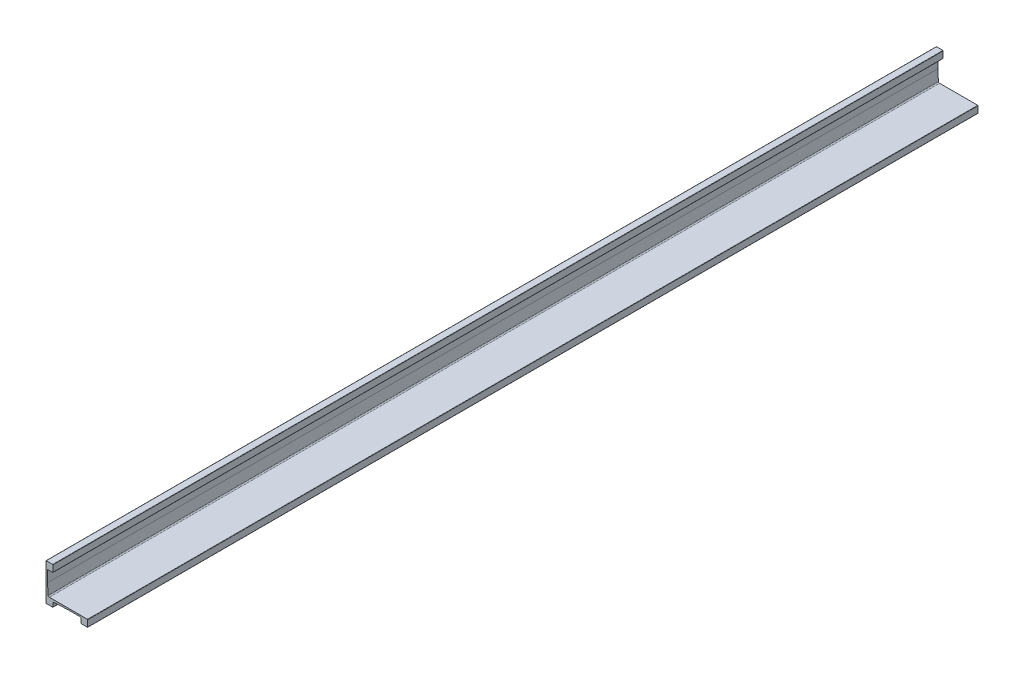
ISO-10303-21;
HEADER;
FILE_DESCRIPTION(('STEP AP214'),'2;1');
FILE_NAME('part.step','',(''),(''),'','','');
FILE_SCHEMA(('AUTOMOTIVE_DESIGN { 1 0 10303 214 1 1 1 1 }'));
ENDSEC;
DATA;
#1=APPLICATION_CONTEXT('core data for automotive mechanical design processes');
#2=APPLICATION_PROTOCOL_DEFINITION('international standard','automotive_design',2000,#1);
#3=PRODUCT_CONTEXT('',#1,'mechanical');
#4=PRODUCT('Part','Part','',(#3));
#5=PRODUCT_RELATED_PRODUCT_CATEGORY('part','',(#4));
#6=PRODUCT_DEFINITION_FORMATION('','',#4);
#7=PRODUCT_DEFINITION_CONTEXT('part definition',#1,'design');
#8=PRODUCT_DEFINITION('design','',#6,#7);
#9=PRODUCT_DEFINITION_SHAPE('','',#8);
#10=(LENGTH_UNIT() NAMED_UNIT(*) SI_UNIT(.MILLI.,.METRE.));
#11=(NAMED_UNIT(*) PLANE_ANGLE_UNIT() SI_UNIT($,.RADIAN.));
#12=(NAMED_UNIT(*) SI_UNIT($,.STERADIAN.) SOLID_ANGLE_UNIT());
#13=UNCERTAINTY_MEASURE_WITH_UNIT(LENGTH_MEASURE(1.E-05),#10,'distance_accuracy_value','');
#14=(GEOMETRIC_REPRESENTATION_CONTEXT(3) GLOBAL_UNCERTAINTY_ASSIGNED_CONTEXT((#13)) GLOBAL_UNIT_ASSIGNED_CONTEXT((#10,
#11,#12)) REPRESENTATION_CONTEXT('',''));
#15=CARTESIAN_POINT('',(0.,0.,0.));
#16=DIRECTION('',(0.,0.,1.));
#17=DIRECTION('',(1.,0.,0.));
#18=AXIS2_PLACEMENT_3D('',#15,#16,#17);
#19=CARTESIAN_POINT('',(9.525,0.,1219.2));
#20=DIRECTION('',(0.,1.,0.));
#21=DIRECTION('',(0.,0.,1.));
#22=AXIS2_PLACEMENT_3D('',#19,#20,#21);
#23=PLANE('',#22);
#24=DIRECTION('',(1.,0.,0.));
#25=VECTOR('',#24,1.);
#26=CARTESIAN_POINT('',(9.525,0.,0.));
#27=LINE('',#26,#25);
#28=CARTESIAN_POINT('',(0.381000000000003,0.,0.));
#29=VERTEX_POINT('',#28);
#30=CARTESIAN_POINT('',(9.144,0.,0.));
#31=VERTEX_POINT('',#30);
#32=EDGE_CURVE('E265',#29,#31,#27,.T.);
#33=ORIENTED_EDGE('',*,*,#32,.T.);
#34=DIRECTION('',(0.,0.,-1.));
#35=VECTOR('',#34,1.);
#36=CARTESIAN_POINT('',(9.144,0.,1219.2));
#37=LINE('',#36,#35);
#38=CARTESIAN_POINT('',(9.144,0.,1219.2));
#39=VERTEX_POINT('',#38);
#40=EDGE_CURVE('E361',#31,#39,#37,.F.);
#41=ORIENTED_EDGE('',*,*,#40,.T.);
#42=DIRECTION('',(1.,0.,0.));
#43=VECTOR('',#42,1.);
#44=CARTESIAN_POINT('',(9.525,0.,1219.2));
#45=LINE('',#44,#43);
#46=CARTESIAN_POINT('',(0.381000000000003,0.,1219.2));
#47=VERTEX_POINT('',#46);
#48=EDGE_CURVE('E302',#47,#39,#45,.T.);
#49=ORIENTED_EDGE('',*,*,#48,.F.);
#50=DIRECTION('',(0.,0.,-1.));
#51=VECTOR('',#50,1.);
#52=CARTESIAN_POINT('',(0.380999999999999,0.,1219.2));
#53=LINE('',#52,#51);
#54=EDGE_CURVE('E358',#47,#29,#53,.T.);
#55=ORIENTED_EDGE('',*,*,#54,.T.);
#56=EDGE_LOOP('',(#33,#41,#49,#55));
#57=FACE_BOUND('',#56,.T.);
#58=ADVANCED_FACE('F33',(#57),#23,.F.);
#59=CARTESIAN_POINT('',(9.525,6.45159999999999,1219.2));
#60=DIRECTION('',(-1.,0.,0.));
#61=DIRECTION('',(0.,0.,1.));
#62=AXIS2_PLACEMENT_3D('',#59,#60,#61);
#63=PLANE('',#62);
#64=DIRECTION('',(0.,1.,0.));
#65=VECTOR('',#64,1.);
#66=CARTESIAN_POINT('',(9.525,6.45159999999999,0.));
#67=LINE('',#66,#65);
#68=CARTESIAN_POINT('',(9.525,0.381,0.));
#69=VERTEX_POINT('',#68);
#70=CARTESIAN_POINT('',(9.525,4.94851302511808,0.));
#71=VERTEX_POINT('',#70);
#72=EDGE_CURVE('E268',#69,#71,#67,.T.);
#73=ORIENTED_EDGE('',*,*,#72,.T.);
#74=DIRECTION('',(0.,0.,-1.));
#75=VECTOR('',#74,1.);
#76=CARTESIAN_POINT('',(9.525,4.94851302511808,1219.2));
#77=LINE('',#76,#75);
#78=CARTESIAN_POINT('',(9.525,4.94851302511808,1219.2));
#79=VERTEX_POINT('',#78);
#80=EDGE_CURVE('E395',#71,#79,#77,.F.);
#81=ORIENTED_EDGE('',*,*,#80,.T.);
#82=DIRECTION('',(0.,1.,0.));
#83=VECTOR('',#82,1.);
#84=CARTESIAN_POINT('',(9.525,6.45159999999999,1219.2));
#85=LINE('',#84,#83);
#86=CARTESIAN_POINT('',(9.525,0.381,1219.2));
#87=VERTEX_POINT('',#86);
#88=EDGE_CURVE('E219',#87,#79,#85,.T.);
#89=ORIENTED_EDGE('',*,*,#88,.F.);
#90=DIRECTION('',(0.,0.,-1.));
#91=VECTOR('',#90,1.);
#92=CARTESIAN_POINT('',(9.525,0.381,1219.2));
#93=LINE('',#92,#91);
#94=EDGE_CURVE('E355',#87,#69,#93,.T.);
#95=ORIENTED_EDGE('',*,*,#94,.T.);
#96=EDGE_LOOP('',(#73,#81,#89,#95));
#97=FACE_BOUND('',#96,.T.);
#98=ADVANCED_FACE('F408',(#97),#63,.F.);
#99=CARTESIAN_POINT('',(28.575,7.49299999999999,1219.2));
#100=DIRECTION('',(-0.054585165145171,0.998509118509227,0.));
#101=DIRECTION('',(-0.998509118509228,-0.054585165145171,0.));
#102=AXIS2_PLACEMENT_3D('',#99,#100,#101);
#103=PLANE('',#102);
#104=DIRECTION('',(0.998509118509227,0.054585165145171,0.));
#105=VECTOR('',#104,1.);
#106=CARTESIAN_POINT('',(28.575,7.49299999999999,1219.2));
#107=LINE('',#106,#105);
#108=CARTESIAN_POINT('',(11.025846050332,6.53364625075148,1219.2));
#109=VERTEX_POINT('',#108);
#110=CARTESIAN_POINT('',(28.575,7.49299999999999,1219.2));
#111=VERTEX_POINT('',#110);
#112=EDGE_CURVE('E206',#109,#111,#107,.T.);
#113=ORIENTED_EDGE('',*,*,#112,.F.);
#114=DIRECTION('',(0.,0.,-1.));
#115=VECTOR('',#114,1.);
#116=CARTESIAN_POINT('',(11.025846050332,6.53364625075148,0.));
#117=LINE('',#116,#115);
#118=CARTESIAN_POINT('',(11.025846050332,6.53364625075148,0.));
#119=VERTEX_POINT('',#118);
#120=EDGE_CURVE('E393',#109,#119,#117,.T.);
#121=ORIENTED_EDGE('',*,*,#120,.T.);
#122=DIRECTION('',(0.998509118509227,0.054585165145171,0.));
#123=VECTOR('',#122,1.);
#124=CARTESIAN_POINT('',(28.575,7.49299999999999,0.));
#125=LINE('',#124,#123);
#126=CARTESIAN_POINT('',(28.575,7.49299999999999,0.));
#127=VERTEX_POINT('',#126);
#128=EDGE_CURVE('E225',#119,#127,#125,.T.);
#129=ORIENTED_EDGE('',*,*,#128,.T.);
#130=DIRECTION('',(0.,0.,-1.));
#131=VECTOR('',#130,1.);
#132=CARTESIAN_POINT('',(28.575,7.49299999999999,1219.2));
#133=LINE('',#132,#131);
#134=EDGE_CURVE('E222',#111,#127,#133,.T.);
#135=ORIENTED_EDGE('',*,*,#134,.F.);
#136=EDGE_LOOP('',(#113,#121,#129,#135));
#137=FACE_BOUND('',#136,.T.);
#138=ADVANCED_FACE('F223',(#137),#103,.F.);
#139=CARTESIAN_POINT('',(47.625,7.49299999999999,1219.2));
#140=DIRECTION('',(0.,1.,0.));
#141=DIRECTION('',(-1.,0.,0.));
#142=AXIS2_PLACEMENT_3D('',#139,#140,#141);
#143=PLANE('',#142);
#144=DIRECTION('',(1.,0.,0.));
#145=VECTOR('',#144,1.);
#146=CARTESIAN_POINT('',(47.625,7.49299999999999,0.));
#147=LINE('',#146,#145);
#148=CARTESIAN_POINT('',(47.244,7.49299999999999,0.));
#149=VERTEX_POINT('',#148);
#150=EDGE_CURVE('E272',#127,#149,#147,.T.);
#151=ORIENTED_EDGE('',*,*,#150,.T.);
#152=DIRECTION('',(0.,0.,-1.));
#153=VECTOR('',#152,1.);
#154=CARTESIAN_POINT('',(47.244,7.49299999999999,1219.2));
#155=LINE('',#154,#153);
#156=CARTESIAN_POINT('',(47.244,7.49299999999999,1219.2));
#157=VERTEX_POINT('',#156);
#158=EDGE_CURVE('E234',#149,#157,#155,.F.);
#159=ORIENTED_EDGE('',*,*,#158,.T.);
#160=DIRECTION('',(1.,0.,0.));
#161=VECTOR('',#160,1.);
#162=CARTESIAN_POINT('',(47.625,7.49299999999999,1219.2));
#163=LINE('',#162,#161);
#164=EDGE_CURVE('E211',#111,#157,#163,.T.);
#165=ORIENTED_EDGE('',*,*,#164,.F.);
#166=ORIENTED_EDGE('',*,*,#134,.T.);
#167=EDGE_LOOP('',(#151,#159,#165,#166));
#168=FACE_BOUND('',#167,.T.);
#169=ADVANCED_FACE('F232',(#168),#143,.F.);
#170=CARTESIAN_POINT('',(47.625,0.,1219.2));
#171=DIRECTION('',(1.,0.,0.));
#172=DIRECTION('',(0.,0.,-1.));
#173=AXIS2_PLACEMENT_3D('',#170,#171,#172);
#174=PLANE('',#173);
#175=DIRECTION('',(0.,-1.,0.));
#176=VECTOR('',#175,1.);
#177=CARTESIAN_POINT('',(47.625,0.,0.));
#178=LINE('',#177,#176);
#179=CARTESIAN_POINT('',(47.625,7.11199999999999,0.));
#180=VERTEX_POINT('',#179);
#181=CARTESIAN_POINT('',(47.625,0.380999999999999,0.));
#182=VERTEX_POINT('',#181);
#183=EDGE_CURVE('E274',#180,#182,#178,.T.);
#184=ORIENTED_EDGE('',*,*,#183,.T.);
#185=DIRECTION('',(0.,0.,-1.));
#186=VECTOR('',#185,1.);
#187=CARTESIAN_POINT('',(47.625,0.380999999999999,1219.2));
#188=LINE('',#187,#186);
#189=CARTESIAN_POINT('',(47.625,0.380999999999999,1219.2));
#190=VERTEX_POINT('',#189);
#191=EDGE_CURVE('E352',#182,#190,#188,.F.);
#192=ORIENTED_EDGE('',*,*,#191,.T.);
#193=DIRECTION('',(0.,-1.,0.));
#194=VECTOR('',#193,1.);
#195=CARTESIAN_POINT('',(47.625,0.,1219.2));
#196=LINE('',#195,#194);
#197=CARTESIAN_POINT('',(47.625,7.11199999999999,1219.2));
#198=VERTEX_POINT('',#197);
#199=EDGE_CURVE('E235',#198,#190,#196,.T.);
#200=ORIENTED_EDGE('',*,*,#199,.F.);
#201=DIRECTION('',(0.,0.,-1.));
#202=VECTOR('',#201,1.);
#203=CARTESIAN_POINT('',(47.625,7.11199999999999,0.));
#204=LINE('',#203,#202);
#205=EDGE_CURVE('E349',#198,#180,#204,.T.);
#206=ORIENTED_EDGE('',*,*,#205,.T.);
#207=EDGE_LOOP('',(#184,#192,#200,#206));
#208=FACE_BOUND('',#207,.T.);
#209=ADVANCED_FACE('F534',(#208),#174,.F.);
#210=CARTESIAN_POINT('',(57.15,0.,1219.2));
#211=DIRECTION('',(0.,1.,0.));
#212=DIRECTION('',(-1.,0.,0.));
#213=AXIS2_PLACEMENT_3D('',#210,#211,#212);
#214=PLANE('',#213);
#215=DIRECTION('',(1.,0.,0.));
#216=VECTOR('',#215,1.);
#217=CARTESIAN_POINT('',(57.15,0.,0.));
#218=LINE('',#217,#216);
#219=CARTESIAN_POINT('',(48.006,0.,0.));
#220=VERTEX_POINT('',#219);
#221=CARTESIAN_POINT('',(56.769,0.,0.));
#222=VERTEX_POINT('',#221);
#223=EDGE_CURVE('E277',#220,#222,#218,.T.);
#224=ORIENTED_EDGE('',*,*,#223,.T.);
#225=DIRECTION('',(0.,0.,-1.));
#226=VECTOR('',#225,1.);
#227=CARTESIAN_POINT('',(56.769,0.,1219.2));
#228=LINE('',#227,#226);
#229=CARTESIAN_POINT('',(56.769,0.,1219.2));
#230=VERTEX_POINT('',#229);
#231=EDGE_CURVE('E347',#222,#230,#228,.F.);
#232=ORIENTED_EDGE('',*,*,#231,.T.);
#233=DIRECTION('',(1.,0.,0.));
#234=VECTOR('',#233,1.);
#235=CARTESIAN_POINT('',(57.15,0.,1219.2));
#236=LINE('',#235,#234);
#237=CARTESIAN_POINT('',(48.006,0.,1219.2));
#238=VERTEX_POINT('',#237);
#239=EDGE_CURVE('E238',#238,#230,#236,.T.);
#240=ORIENTED_EDGE('',*,*,#239,.F.);
#241=DIRECTION('',(0.,0.,-1.));
#242=VECTOR('',#241,1.);
#243=CARTESIAN_POINT('',(48.006,0.,1219.2));
#244=LINE('',#243,#242);
#245=EDGE_CURVE('E344',#238,#220,#244,.T.);
#246=ORIENTED_EDGE('',*,*,#245,.T.);
#247=EDGE_LOOP('',(#224,#232,#240,#246));
#248=FACE_BOUND('',#247,.T.);
#249=ADVANCED_FACE('F527',(#248),#214,.F.);
#250=CARTESIAN_POINT('',(57.15,9.52499999999999,1219.2));
#251=DIRECTION('',(-1.,0.,0.));
#252=DIRECTION('',(0.,0.,1.));
#253=AXIS2_PLACEMENT_3D('',#250,#251,#252);
#254=PLANE('',#253);
#255=DIRECTION('',(0.,1.,0.));
#256=VECTOR('',#255,1.);
#257=CARTESIAN_POINT('',(57.15,9.52499999999999,0.));
#258=LINE('',#257,#256);
#259=CARTESIAN_POINT('',(57.15,0.381000000000001,0.));
#260=VERTEX_POINT('',#259);
#261=CARTESIAN_POINT('',(57.15,9.14399999999999,0.));
#262=VERTEX_POINT('',#261);
#263=EDGE_CURVE('E280',#260,#262,#258,.T.);
#264=ORIENTED_EDGE('',*,*,#263,.T.);
#265=DIRECTION('',(0.,0.,-1.));
#266=VECTOR('',#265,1.);
#267=CARTESIAN_POINT('',(57.15,9.14399999999999,1219.2));
#268=LINE('',#267,#266);
#269=CARTESIAN_POINT('',(57.15,9.14399999999999,1219.2));
#270=VERTEX_POINT('',#269);
#271=EDGE_CURVE('E326',#262,#270,#268,.F.);
#272=ORIENTED_EDGE('',*,*,#271,.T.);
#273=DIRECTION('',(0.,1.,0.));
#274=VECTOR('',#273,1.);
#275=CARTESIAN_POINT('',(57.15,9.52499999999999,1219.2));
#276=LINE('',#275,#274);
#277=CARTESIAN_POINT('',(57.15,0.381000000000001,1219.2));
#278=VERTEX_POINT('',#277);
#279=EDGE_CURVE('E244',#278,#270,#276,.T.);
#280=ORIENTED_EDGE('',*,*,#279,.F.);
#281=DIRECTION('',(0.,0.,-1.));
#282=VECTOR('',#281,1.);
#283=CARTESIAN_POINT('',(57.15,0.381000000000001,1219.2));
#284=LINE('',#283,#282);
#285=EDGE_CURVE('E323',#278,#260,#284,.T.);
#286=ORIENTED_EDGE('',*,*,#285,.T.);
#287=EDGE_LOOP('',(#264,#272,#280,#286));
#288=FACE_BOUND('',#287,.T.);
#289=ADVANCED_FACE('F520',(#288),#254,.F.);
#290=CARTESIAN_POINT('',(3.0734,9.52499999999999,1219.2));
#291=DIRECTION('',(0.,-1.,0.));
#292=DIRECTION('',(0.,0.,-1.));
#293=AXIS2_PLACEMENT_3D('',#290,#291,#292);
#294=PLANE('',#293);
#295=DIRECTION('',(-1.,0.,0.));
#296=VECTOR('',#295,1.);
#297=CARTESIAN_POINT('',(3.0734,9.52499999999999,0.));
#298=LINE('',#297,#296);
#299=CARTESIAN_POINT('',(56.769,9.52499999999999,0.));
#300=VERTEX_POINT('',#299);
#301=CARTESIAN_POINT('',(4.56017212504022,9.52499999999999,0.));
#302=VERTEX_POINT('',#301);
#303=EDGE_CURVE('E283',#300,#302,#298,.T.);
#304=ORIENTED_EDGE('',*,*,#303,.T.);
#305=DIRECTION('',(0.,0.,-1.));
#306=VECTOR('',#305,1.);
#307=CARTESIAN_POINT('',(4.56017212504022,9.52499999999999,1219.2));
#308=LINE('',#307,#306);
#309=CARTESIAN_POINT('',(4.56017212504022,9.52499999999999,1219.2));
#310=VERTEX_POINT('',#309);
#311=EDGE_CURVE('E54',#302,#310,#308,.F.);
#312=ORIENTED_EDGE('',*,*,#311,.T.);
#313=DIRECTION('',(-1.,0.,0.));
#314=VECTOR('',#313,1.);
#315=CARTESIAN_POINT('',(3.0734,9.52499999999999,1219.2));
#316=LINE('',#315,#314);
#317=CARTESIAN_POINT('',(56.769,9.52499999999999,1219.2));
#318=VERTEX_POINT('',#317);
#319=EDGE_CURVE('E246',#318,#310,#316,.T.);
#320=ORIENTED_EDGE('',*,*,#319,.F.);
#321=DIRECTION('',(0.,0.,-1.));
#322=VECTOR('',#321,1.);
#323=CARTESIAN_POINT('',(56.769,9.52499999999999,1219.2));
#324=LINE('',#323,#322);
#325=EDGE_CURVE('E229',#318,#300,#324,.T.);
#326=ORIENTED_EDGE('',*,*,#325,.T.);
#327=EDGE_LOOP('',(#304,#312,#320,#326));
#328=FACE_BOUND('',#327,.T.);
#329=ADVANCED_FACE('F516',(#328),#294,.F.);
#330=CARTESIAN_POINT('',(2.032,25.4,1219.2));
#331=DIRECTION('',(-0.997855239779421,-0.0654593037295299,0.));
#332=DIRECTION('',(0.0654593037295299,-0.997855239779421,0.));
#333=AXIS2_PLACEMENT_3D('',#330,#331,#332);
#334=PLANE('',#333);
#335=DIRECTION('',(-0.0654593037295299,0.997855239779421,0.));
#336=VECTOR('',#335,1.);
#337=CARTESIAN_POINT('',(2.032,25.4,1219.2));
#338=LINE('',#337,#336);
#339=CARTESIAN_POINT('',(2.97607693189039,11.0085833553294,1219.2));
#340=VERTEX_POINT('',#339);
#341=CARTESIAN_POINT('',(2.032,25.4,1219.2));
#342=VERTEX_POINT('',#341);
#343=EDGE_CURVE('E248',#340,#342,#338,.T.);
#344=ORIENTED_EDGE('',*,*,#343,.F.);
#345=DIRECTION('',(0.,0.,-1.));
#346=VECTOR('',#345,1.);
#347=CARTESIAN_POINT('',(2.97607693189039,11.0085833553294,0.));
#348=LINE('',#347,#346);
#349=CARTESIAN_POINT('',(2.97607693189039,11.0085833553294,0.));
#350=VERTEX_POINT('',#349);
#351=EDGE_CURVE('E397',#340,#350,#348,.T.);
#352=ORIENTED_EDGE('',*,*,#351,.T.);
#353=DIRECTION('',(-0.0654593037295299,0.997855239779421,0.));
#354=VECTOR('',#353,1.);
#355=CARTESIAN_POINT('',(2.032,25.4,0.));
#356=LINE('',#355,#354);
#357=CARTESIAN_POINT('',(2.032,25.4,0.));
#358=VERTEX_POINT('',#357);
#359=EDGE_CURVE('E285',#350,#358,#356,.T.);
#360=ORIENTED_EDGE('',*,*,#359,.T.);
#361=DIRECTION('',(0.,0.,-1.));
#362=VECTOR('',#361,1.);
#363=CARTESIAN_POINT('',(2.032,25.4,1219.2));
#364=LINE('',#363,#362);
#365=EDGE_CURVE('E230',#342,#358,#364,.T.);
#366=ORIENTED_EDGE('',*,*,#365,.F.);
#367=EDGE_LOOP('',(#344,#352,#360,#366));
#368=FACE_BOUND('',#367,.T.);
#369=ADVANCED_FACE('F511',(#368),#334,.F.);
#370=CARTESIAN_POINT('',(2.032,41.275,1219.2));
#371=DIRECTION('',(-1.,0.,0.));
#372=DIRECTION('',(0.,-1.,0.));
#373=AXIS2_PLACEMENT_3D('',#370,#371,#372);
#374=PLANE('',#373);
#375=DIRECTION('',(0.,1.,0.));
#376=VECTOR('',#375,1.);
#377=CARTESIAN_POINT('',(2.032,41.275,0.));
#378=LINE('',#377,#376);
#379=CARTESIAN_POINT('',(2.032,40.894,0.));
#380=VERTEX_POINT('',#379);
#381=EDGE_CURVE('E287',#358,#380,#378,.T.);
#382=ORIENTED_EDGE('',*,*,#381,.T.);
#383=DIRECTION('',(0.,0.,-1.));
#384=VECTOR('',#383,1.);
#385=CARTESIAN_POINT('',(2.032,40.894,1219.2));
#386=LINE('',#385,#384);
#387=CARTESIAN_POINT('',(2.032,40.894,1219.2));
#388=VERTEX_POINT('',#387);
#389=EDGE_CURVE('E373',#380,#388,#386,.F.);
#390=ORIENTED_EDGE('',*,*,#389,.T.);
#391=DIRECTION('',(0.,1.,0.));
#392=VECTOR('',#391,1.);
#393=CARTESIAN_POINT('',(2.032,41.275,1219.2));
#394=LINE('',#393,#392);
#395=EDGE_CURVE('E250',#342,#388,#394,.T.);
#396=ORIENTED_EDGE('',*,*,#395,.F.);
#397=ORIENTED_EDGE('',*,*,#365,.T.);
#398=EDGE_LOOP('',(#382,#390,#396,#397));
#399=FACE_BOUND('',#398,.T.);
#400=ADVANCED_FACE('F506',(#399),#374,.F.);
#401=CARTESIAN_POINT('',(9.525,41.275,1219.2));
#402=DIRECTION('',(0.,1.,0.));
#403=DIRECTION('',(0.,0.,1.));
#404=AXIS2_PLACEMENT_3D('',#401,#402,#403);
#405=PLANE('',#404);
#406=DIRECTION('',(1.,0.,0.));
#407=VECTOR('',#406,1.);
#408=CARTESIAN_POINT('',(9.525,41.275,1219.2));
#409=LINE('',#408,#407);
#410=CARTESIAN_POINT('',(2.413,41.275,1219.2));
#411=VERTEX_POINT('',#410);
#412=CARTESIAN_POINT('',(9.144,41.275,1219.2));
#413=VERTEX_POINT('',#412);
#414=EDGE_CURVE('E253',#411,#413,#409,.T.);
#415=ORIENTED_EDGE('',*,*,#414,.F.);
#416=DIRECTION('',(0.,0.,-1.));
#417=VECTOR('',#416,1.);
#418=CARTESIAN_POINT('',(2.413,41.275,0.));
#419=LINE('',#418,#417);
#420=CARTESIAN_POINT('',(2.413,41.275,0.));
#421=VERTEX_POINT('',#420);
#422=EDGE_CURVE('E370',#411,#421,#419,.T.);
#423=ORIENTED_EDGE('',*,*,#422,.T.);
#424=DIRECTION('',(1.,0.,0.));
#425=VECTOR('',#424,1.);
#426=CARTESIAN_POINT('',(9.525,41.275,0.));
#427=LINE('',#426,#425);
#428=CARTESIAN_POINT('',(9.144,41.275,0.));
#429=VERTEX_POINT('',#428);
#430=EDGE_CURVE('E290',#421,#429,#427,.T.);
#431=ORIENTED_EDGE('',*,*,#430,.T.);
#432=DIRECTION('',(0.,0.,-1.));
#433=VECTOR('',#432,1.);
#434=CARTESIAN_POINT('',(9.144,41.275,1219.2));
#435=LINE('',#434,#433);
#436=EDGE_CURVE('E368',#429,#413,#435,.F.);
#437=ORIENTED_EDGE('',*,*,#436,.T.);
#438=EDGE_LOOP('',(#415,#423,#431,#437));
#439=FACE_BOUND('',#438,.T.);
#440=ADVANCED_FACE('F500',(#439),#405,.F.);
#441=CARTESIAN_POINT('',(9.525,50.8,1219.2));
#442=DIRECTION('',(-1.,0.,0.));
#443=DIRECTION('',(0.,-1.,0.));
#444=AXIS2_PLACEMENT_3D('',#441,#442,#443);
#445=PLANE('',#444);
#446=DIRECTION('',(0.,1.,0.));
#447=VECTOR('',#446,1.);
#448=CARTESIAN_POINT('',(9.525,50.8,1219.2));
#449=LINE('',#448,#447);
#450=CARTESIAN_POINT('',(9.525,41.656,1219.2));
#451=VERTEX_POINT('',#450);
#452=CARTESIAN_POINT('',(9.525,50.419,1219.2));
#453=VERTEX_POINT('',#452);
#454=EDGE_CURVE('E256',#451,#453,#449,.T.);
#455=ORIENTED_EDGE('',*,*,#454,.F.);
#456=DIRECTION('',(0.,0.,-1.));
#457=VECTOR('',#456,1.);
#458=CARTESIAN_POINT('',(9.525,41.656,1219.2));
#459=LINE('',#458,#457);
#460=CARTESIAN_POINT('',(9.525,41.656,0.));
#461=VERTEX_POINT('',#460);
#462=EDGE_CURVE('E377',#451,#461,#459,.T.);
#463=ORIENTED_EDGE('',*,*,#462,.T.);
#464=DIRECTION('',(0.,1.,0.));
#465=VECTOR('',#464,1.);
#466=CARTESIAN_POINT('',(9.525,50.8,0.));
#467=LINE('',#466,#465);
#468=CARTESIAN_POINT('',(9.525,50.419,0.));
#469=VERTEX_POINT('',#468);
#470=EDGE_CURVE('E293',#461,#469,#467,.T.);
#471=ORIENTED_EDGE('',*,*,#470,.T.);
#472=DIRECTION('',(0.,0.,-1.));
#473=VECTOR('',#472,1.);
#474=CARTESIAN_POINT('',(9.525,50.419,1219.2));
#475=LINE('',#474,#473);
#476=EDGE_CURVE('E375',#469,#453,#475,.F.);
#477=ORIENTED_EDGE('',*,*,#476,.T.);
#478=EDGE_LOOP('',(#455,#463,#471,#477));
#479=FACE_BOUND('',#478,.T.);
#480=ADVANCED_FACE('F493',(#479),#445,.F.);
#481=CARTESIAN_POINT('',(0.,50.8,1219.2));
#482=DIRECTION('',(0.,-1.,0.));
#483=DIRECTION('',(0.,0.,-1.));
#484=AXIS2_PLACEMENT_3D('',#481,#482,#483);
#485=PLANE('',#484);
#486=DIRECTION('',(-1.,0.,0.));
#487=VECTOR('',#486,1.);
#488=CARTESIAN_POINT('',(0.,50.8,1219.2));
#489=LINE('',#488,#487);
#490=CARTESIAN_POINT('',(9.144,50.8,1219.2));
#491=VERTEX_POINT('',#490);
#492=CARTESIAN_POINT('',(0.381,50.8,1219.2));
#493=VERTEX_POINT('',#492);
#494=EDGE_CURVE('E259',#491,#493,#489,.T.);
#495=ORIENTED_EDGE('',*,*,#494,.F.);
#496=DIRECTION('',(0.,0.,-1.));
#497=VECTOR('',#496,1.);
#498=CARTESIAN_POINT('',(9.144,50.8,1219.2));
#499=LINE('',#498,#497);
#500=CARTESIAN_POINT('',(9.144,50.8,0.));
#501=VERTEX_POINT('',#500);
#502=EDGE_CURVE('E382',#491,#501,#499,.T.);
#503=ORIENTED_EDGE('',*,*,#502,.T.);
#504=DIRECTION('',(-1.,0.,0.));
#505=VECTOR('',#504,1.);
#506=CARTESIAN_POINT('',(0.,50.8,0.));
#507=LINE('',#506,#505);
#508=CARTESIAN_POINT('',(0.381,50.8,0.));
#509=VERTEX_POINT('',#508);
#510=EDGE_CURVE('E296',#501,#509,#507,.T.);
#511=ORIENTED_EDGE('',*,*,#510,.T.);
#512=DIRECTION('',(0.,0.,-1.));
#513=VECTOR('',#512,1.);
#514=CARTESIAN_POINT('',(0.381,50.8,1219.2));
#515=LINE('',#514,#513);
#516=EDGE_CURVE('E380',#509,#493,#515,.F.);
#517=ORIENTED_EDGE('',*,*,#516,.T.);
#518=EDGE_LOOP('',(#495,#503,#511,#517));
#519=FACE_BOUND('',#518,.T.);
#520=ADVANCED_FACE('F474',(#519),#485,.F.);
#521=CARTESIAN_POINT('',(0.,0.,1219.2));
#522=DIRECTION('',(1.,0.,0.));
#523=DIRECTION('',(0.,0.,-1.));
#524=AXIS2_PLACEMENT_3D('',#521,#522,#523);
#525=PLANE('',#524);
#526=DIRECTION('',(0.,-1.,0.));
#527=VECTOR('',#526,1.);
#528=CARTESIAN_POINT('',(0.,0.,0.));
#529=LINE('',#528,#527);
#530=CARTESIAN_POINT('',(0.,50.419,0.));
#531=VERTEX_POINT('',#530);
#532=CARTESIAN_POINT('',(0.,0.381,0.));
#533=VERTEX_POINT('',#532);
#534=EDGE_CURVE('E299',#531,#533,#529,.T.);
#535=ORIENTED_EDGE('',*,*,#534,.T.);
#536=DIRECTION('',(0.,0.,-1.));
#537=VECTOR('',#536,1.);
#538=CARTESIAN_POINT('',(0.,0.381,1219.2));
#539=LINE('',#538,#537);
#540=CARTESIAN_POINT('',(0.,0.381,1219.2));
#541=VERTEX_POINT('',#540);
#542=EDGE_CURVE('E366',#533,#541,#539,.F.);
#543=ORIENTED_EDGE('',*,*,#542,.T.);
#544=DIRECTION('',(0.,-1.,0.));
#545=VECTOR('',#544,1.);
#546=CARTESIAN_POINT('',(0.,0.,1219.2));
#547=LINE('',#546,#545);
#548=CARTESIAN_POINT('',(0.,50.419,1219.2));
#549=VERTEX_POINT('',#548);
#550=EDGE_CURVE('E262',#549,#541,#547,.T.);
#551=ORIENTED_EDGE('',*,*,#550,.F.);
#552=DIRECTION('',(0.,0.,-1.));
#553=VECTOR('',#552,1.);
#554=CARTESIAN_POINT('',(0.,50.419,1219.2));
#555=LINE('',#554,#553);
#556=EDGE_CURVE('E363',#549,#531,#555,.T.);
#557=ORIENTED_EDGE('',*,*,#556,.T.);
#558=EDGE_LOOP('',(#535,#543,#551,#557));
#559=FACE_BOUND('',#558,.T.);
#560=ADVANCED_FACE('F481',(#559),#525,.F.);
#561=CARTESIAN_POINT('',(0.,0.,1219.2));
#562=DIRECTION('',(0.,0.,-1.));
#563=DIRECTION('',(-1.,0.,0.));
#564=AXIS2_PLACEMENT_3D('',#561,#562,#563);
#565=PLANE('',#564);
#566=ORIENTED_EDGE('',*,*,#279,.T.);
#567=CARTESIAN_POINT('',(56.769,9.14399999999999,1219.2));
#568=DIRECTION('',(0.,0.,-1.));
#569=DIRECTION('',(-1.,0.,0.));
#570=AXIS2_PLACEMENT_3D('',#567,#568,#569);
#571=CIRCLE('',#570,0.381);
#572=EDGE_CURVE('E342',#270,#318,#571,.F.);
#573=ORIENTED_EDGE('',*,*,#572,.T.);
#574=ORIENTED_EDGE('',*,*,#319,.T.);
#575=CARTESIAN_POINT('',(4.56017212504022,11.1125,1219.2));
#576=DIRECTION('',(0.,0.,-1.));
#577=DIRECTION('',(-1.,0.,0.));
#578=AXIS2_PLACEMENT_3D('',#575,#576,#577);
#579=CIRCLE('',#578,1.5875);
#580=EDGE_CURVE('E11',#310,#340,#579,.T.);
#581=ORIENTED_EDGE('',*,*,#580,.T.);
#582=ORIENTED_EDGE('',*,*,#343,.T.);
#583=ORIENTED_EDGE('',*,*,#395,.T.);
#584=CARTESIAN_POINT('',(2.413,40.894,1219.2));
#585=DIRECTION('',(0.,0.,-1.));
#586=DIRECTION('',(-1.,0.,0.));
#587=AXIS2_PLACEMENT_3D('',#584,#585,#586);
#588=CIRCLE('',#587,0.381);
#589=EDGE_CURVE('E391',#388,#411,#588,.T.);
#590=ORIENTED_EDGE('',*,*,#589,.T.);
#591=ORIENTED_EDGE('',*,*,#414,.T.);
#592=CARTESIAN_POINT('',(9.144,41.656,1219.2));
#593=DIRECTION('',(0.,0.,-1.));
#594=DIRECTION('',(-1.,0.,0.));
#595=AXIS2_PLACEMENT_3D('',#592,#593,#594);
#596=CIRCLE('',#595,0.381);
#597=EDGE_CURVE('E332',#413,#451,#596,.F.);
#598=ORIENTED_EDGE('',*,*,#597,.T.);
#599=ORIENTED_EDGE('',*,*,#454,.T.);
#600=CARTESIAN_POINT('',(9.144,50.419,1219.2));
#601=DIRECTION('',(0.,0.,-1.));
#602=DIRECTION('',(-1.,0.,0.));
#603=AXIS2_PLACEMENT_3D('',#600,#601,#602);
#604=CIRCLE('',#603,0.381);
#605=EDGE_CURVE('E330',#453,#491,#604,.F.);
#606=ORIENTED_EDGE('',*,*,#605,.T.);
#607=ORIENTED_EDGE('',*,*,#494,.T.);
#608=CARTESIAN_POINT('',(0.381,50.419,1219.2));
#609=DIRECTION('',(0.,0.,-1.));
#610=DIRECTION('',(-1.,0.,0.));
#611=AXIS2_PLACEMENT_3D('',#608,#609,#610);
#612=CIRCLE('',#611,0.381);
#613=EDGE_CURVE('E328',#493,#549,#612,.F.);
#614=ORIENTED_EDGE('',*,*,#613,.T.);
#615=ORIENTED_EDGE('',*,*,#550,.T.);
#616=CARTESIAN_POINT('',(0.380999999999999,0.381,1219.2));
#617=DIRECTION('',(0.,0.,-1.));
#618=DIRECTION('',(-1.,0.,0.));
#619=AXIS2_PLACEMENT_3D('',#616,#617,#618);
#620=CIRCLE('',#619,0.381);
#621=EDGE_CURVE('E334',#541,#47,#620,.F.);
#622=ORIENTED_EDGE('',*,*,#621,.T.);
#623=ORIENTED_EDGE('',*,*,#48,.T.);
#624=CARTESIAN_POINT('',(9.144,0.381,1219.2));
#625=DIRECTION('',(0.,0.,-1.));
#626=DIRECTION('',(-1.,0.,0.));
#627=AXIS2_PLACEMENT_3D('',#624,#625,#626);
#628=CIRCLE('',#627,0.381);
#629=EDGE_CURVE('E336',#39,#87,#628,.F.);
#630=ORIENTED_EDGE('',*,*,#629,.T.);
#631=ORIENTED_EDGE('',*,*,#88,.T.);
#632=CARTESIAN_POINT('',(11.1125,4.94851302511808,1219.2));
#633=DIRECTION('',(0.,0.,-1.));
#634=DIRECTION('',(-1.,0.,0.));
#635=AXIS2_PLACEMENT_3D('',#632,#633,#634);
#636=CIRCLE('',#635,1.5875);
#637=EDGE_CURVE('E215',#79,#109,#636,.T.);
#638=ORIENTED_EDGE('',*,*,#637,.T.);
#639=ORIENTED_EDGE('',*,*,#112,.T.);
#640=ORIENTED_EDGE('',*,*,#164,.T.);
#641=CARTESIAN_POINT('',(47.244,7.11199999999999,1219.2));
#642=DIRECTION('',(0.,0.,-1.));
#643=DIRECTION('',(-1.,0.,0.));
#644=AXIS2_PLACEMENT_3D('',#641,#642,#643);
#645=CIRCLE('',#644,0.381);
#646=EDGE_CURVE('E387',#157,#198,#645,.T.);
#647=ORIENTED_EDGE('',*,*,#646,.T.);
#648=ORIENTED_EDGE('',*,*,#199,.T.);
#649=CARTESIAN_POINT('',(48.006,0.380999999999999,1219.2));
#650=DIRECTION('',(0.,0.,-1.));
#651=DIRECTION('',(-1.,0.,0.));
#652=AXIS2_PLACEMENT_3D('',#649,#650,#651);
#653=CIRCLE('',#652,0.381);
#654=EDGE_CURVE('E338',#190,#238,#653,.F.);
#655=ORIENTED_EDGE('',*,*,#654,.T.);
#656=ORIENTED_EDGE('',*,*,#239,.T.);
#657=CARTESIAN_POINT('',(56.769,0.381000000000001,1219.2));
#658=DIRECTION('',(0.,0.,-1.));
#659=DIRECTION('',(-1.,0.,0.));
#660=AXIS2_PLACEMENT_3D('',#657,#658,#659);
#661=CIRCLE('',#660,0.381);
#662=EDGE_CURVE('E340',#230,#278,#661,.F.);
#663=ORIENTED_EDGE('',*,*,#662,.T.);
#664=EDGE_LOOP('',(#566,#573,#574,#581,#582,#583,#590,#591,#598,#599,#606,#607,#614,#615,#622,
#623,#630,#631,#638,#639,#640,#647,#648,#655,#656,#663));
#665=FACE_BOUND('',#664,.T.);
#666=ADVANCED_FACE('F209',(#665),#565,.F.);
#667=CARTESIAN_POINT('',(0.,0.,0.));
#668=DIRECTION('',(0.,0.,-1.));
#669=DIRECTION('',(-1.,0.,0.));
#670=AXIS2_PLACEMENT_3D('',#667,#668,#669);
#671=PLANE('',#670);
#672=ORIENTED_EDGE('',*,*,#303,.F.);
#673=CARTESIAN_POINT('',(56.769,9.14399999999999,0.));
#674=DIRECTION('',(0.,0.,-1.));
#675=DIRECTION('',(-1.,0.,0.));
#676=AXIS2_PLACEMENT_3D('',#673,#674,#675);
#677=CIRCLE('',#676,0.381);
#678=EDGE_CURVE('E321',#300,#262,#677,.T.);
#679=ORIENTED_EDGE('',*,*,#678,.T.);
#680=ORIENTED_EDGE('',*,*,#263,.F.);
#681=CARTESIAN_POINT('',(56.769,0.381000000000001,0.));
#682=DIRECTION('',(0.,0.,-1.));
#683=DIRECTION('',(-1.,0.,0.));
#684=AXIS2_PLACEMENT_3D('',#681,#682,#683);
#685=CIRCLE('',#684,0.381);
#686=EDGE_CURVE('E319',#260,#222,#685,.T.);
#687=ORIENTED_EDGE('',*,*,#686,.T.);
#688=ORIENTED_EDGE('',*,*,#223,.F.);
#689=CARTESIAN_POINT('',(48.006,0.380999999999999,0.));
#690=DIRECTION('',(0.,0.,-1.));
#691=DIRECTION('',(-1.,0.,0.));
#692=AXIS2_PLACEMENT_3D('',#689,#690,#691);
#693=CIRCLE('',#692,0.381);
#694=EDGE_CURVE('E317',#220,#182,#693,.T.);
#695=ORIENTED_EDGE('',*,*,#694,.T.);
#696=ORIENTED_EDGE('',*,*,#183,.F.);
#697=CARTESIAN_POINT('',(47.244,7.11199999999999,0.));
#698=DIRECTION('',(0.,0.,-1.));
#699=DIRECTION('',(-1.,0.,0.));
#700=AXIS2_PLACEMENT_3D('',#697,#698,#699);
#701=CIRCLE('',#700,0.381);
#702=EDGE_CURVE('E385',#180,#149,#701,.F.);
#703=ORIENTED_EDGE('',*,*,#702,.T.);
#704=ORIENTED_EDGE('',*,*,#150,.F.);
#705=ORIENTED_EDGE('',*,*,#128,.F.);
#706=CARTESIAN_POINT('',(11.1125,4.94851302511808,0.));
#707=DIRECTION('',(0.,0.,-1.));
#708=DIRECTION('',(-1.,0.,0.));
#709=AXIS2_PLACEMENT_3D('',#706,#707,#708);
#710=CIRCLE('',#709,1.5875);
#711=EDGE_CURVE('E401',#119,#71,#710,.F.);
#712=ORIENTED_EDGE('',*,*,#711,.T.);
#713=ORIENTED_EDGE('',*,*,#72,.F.);
#714=CARTESIAN_POINT('',(9.144,0.381,0.));
#715=DIRECTION('',(0.,0.,-1.));
#716=DIRECTION('',(-1.,0.,0.));
#717=AXIS2_PLACEMENT_3D('',#714,#715,#716);
#718=CIRCLE('',#717,0.381);
#719=EDGE_CURVE('E315',#69,#31,#718,.T.);
#720=ORIENTED_EDGE('',*,*,#719,.T.);
#721=ORIENTED_EDGE('',*,*,#32,.F.);
#722=CARTESIAN_POINT('',(0.380999999999999,0.381,0.));
#723=DIRECTION('',(0.,0.,-1.));
#724=DIRECTION('',(-1.,0.,0.));
#725=AXIS2_PLACEMENT_3D('',#722,#723,#724);
#726=CIRCLE('',#725,0.381);
#727=EDGE_CURVE('E313',#29,#533,#726,.T.);
#728=ORIENTED_EDGE('',*,*,#727,.T.);
#729=ORIENTED_EDGE('',*,*,#534,.F.);
#730=CARTESIAN_POINT('',(0.381,50.419,0.));
#731=DIRECTION('',(0.,0.,-1.));
#732=DIRECTION('',(-1.,0.,0.));
#733=AXIS2_PLACEMENT_3D('',#730,#731,#732);
#734=CIRCLE('',#733,0.381);
#735=EDGE_CURVE('E307',#531,#509,#734,.T.);
#736=ORIENTED_EDGE('',*,*,#735,.T.);
#737=ORIENTED_EDGE('',*,*,#510,.F.);
#738=CARTESIAN_POINT('',(9.144,50.419,0.));
#739=DIRECTION('',(0.,0.,-1.));
#740=DIRECTION('',(-1.,0.,0.));
#741=AXIS2_PLACEMENT_3D('',#738,#739,#740);
#742=CIRCLE('',#741,0.381);
#743=EDGE_CURVE('E309',#501,#469,#742,.T.);
#744=ORIENTED_EDGE('',*,*,#743,.T.);
#745=ORIENTED_EDGE('',*,*,#470,.F.);
#746=CARTESIAN_POINT('',(9.144,41.656,0.));
#747=DIRECTION('',(0.,0.,-1.));
#748=DIRECTION('',(-1.,0.,0.));
#749=AXIS2_PLACEMENT_3D('',#746,#747,#748);
#750=CIRCLE('',#749,0.381);
#751=EDGE_CURVE('E311',#461,#429,#750,.T.);
#752=ORIENTED_EDGE('',*,*,#751,.T.);
#753=ORIENTED_EDGE('',*,*,#430,.F.);
#754=CARTESIAN_POINT('',(2.413,40.894,0.));
#755=DIRECTION('',(0.,0.,-1.));
#756=DIRECTION('',(-1.,0.,0.));
#757=AXIS2_PLACEMENT_3D('',#754,#755,#756);
#758=CIRCLE('',#757,0.381);
#759=EDGE_CURVE('E389',#421,#380,#758,.F.);
#760=ORIENTED_EDGE('',*,*,#759,.T.);
#761=ORIENTED_EDGE('',*,*,#381,.F.);
#762=ORIENTED_EDGE('',*,*,#359,.F.);
#763=CARTESIAN_POINT('',(4.56017212504022,11.1125,0.));
#764=DIRECTION('',(0.,0.,-1.));
#765=DIRECTION('',(-1.,0.,0.));
#766=AXIS2_PLACEMENT_3D('',#763,#764,#765);
#767=CIRCLE('',#766,1.5875);
#768=EDGE_CURVE('E41',#350,#302,#767,.F.);
#769=ORIENTED_EDGE('',*,*,#768,.T.);
#770=EDGE_LOOP('',(#672,#679,#680,#687,#688,#695,#696,#703,#704,#705,#712,#713,#720,#721,#728,
#729,#736,#737,#744,#745,#752,#753,#760,#761,#762,#769));
#771=FACE_BOUND('',#770,.T.);
#772=ADVANCED_FACE('F404',(#771),#671,.T.);
#773=CARTESIAN_POINT('',(56.769,9.14399999999999,1219.2));
#774=DIRECTION('',(0.,0.,-1.));
#775=DIRECTION('',(-1.,0.,0.));
#776=AXIS2_PLACEMENT_3D('',#773,#774,#775);
#777=CYLINDRICAL_SURFACE('',#776,0.381);
#778=ORIENTED_EDGE('',*,*,#572,.F.);
#779=ORIENTED_EDGE('',*,*,#271,.F.);
#780=ORIENTED_EDGE('',*,*,#678,.F.);
#781=ORIENTED_EDGE('',*,*,#325,.F.);
#782=EDGE_LOOP('',(#778,#779,#780,#781));
#783=FACE_BOUND('',#782,.T.);
#784=ADVANCED_FACE('F431',(#783),#777,.T.);
#785=CARTESIAN_POINT('',(56.769,0.381000000000001,1219.2));
#786=DIRECTION('',(0.,0.,-1.));
#787=DIRECTION('',(-1.,0.,0.));
#788=AXIS2_PLACEMENT_3D('',#785,#786,#787);
#789=CYLINDRICAL_SURFACE('',#788,0.381);
#790=ORIENTED_EDGE('',*,*,#662,.F.);
#791=ORIENTED_EDGE('',*,*,#231,.F.);
#792=ORIENTED_EDGE('',*,*,#686,.F.);
#793=ORIENTED_EDGE('',*,*,#285,.F.);
#794=EDGE_LOOP('',(#790,#791,#792,#793));
#795=FACE_BOUND('',#794,.T.);
#796=ADVANCED_FACE('F434',(#795),#789,.T.);
#797=CARTESIAN_POINT('',(48.006,0.380999999999999,1219.2));
#798=DIRECTION('',(0.,0.,-1.));
#799=DIRECTION('',(-1.,0.,0.));
#800=AXIS2_PLACEMENT_3D('',#797,#798,#799);
#801=CYLINDRICAL_SURFACE('',#800,0.381);
#802=ORIENTED_EDGE('',*,*,#654,.F.);
#803=ORIENTED_EDGE('',*,*,#191,.F.);
#804=ORIENTED_EDGE('',*,*,#694,.F.);
#805=ORIENTED_EDGE('',*,*,#245,.F.);
#806=EDGE_LOOP('',(#802,#803,#804,#805));
#807=FACE_BOUND('',#806,.T.);
#808=ADVANCED_FACE('F438',(#807),#801,.T.);
#809=CARTESIAN_POINT('',(47.244,7.11199999999999,1219.2));
#810=DIRECTION('',(0.,0.,1.));
#811=DIRECTION('',(1.,0.,0.));
#812=AXIS2_PLACEMENT_3D('',#809,#810,#811);
#813=CYLINDRICAL_SURFACE('',#812,0.381);
#814=ORIENTED_EDGE('',*,*,#646,.F.);
#815=ORIENTED_EDGE('',*,*,#158,.F.);
#816=ORIENTED_EDGE('',*,*,#702,.F.);
#817=ORIENTED_EDGE('',*,*,#205,.F.);
#818=EDGE_LOOP('',(#814,#815,#816,#817));
#819=FACE_BOUND('',#818,.T.);
#820=ADVANCED_FACE('F442',(#819),#813,.F.);
#821=CARTESIAN_POINT('',(9.144,0.381,1219.2));
#822=DIRECTION('',(0.,0.,-1.));
#823=DIRECTION('',(-1.,0.,0.));
#824=AXIS2_PLACEMENT_3D('',#821,#822,#823);
#825=CYLINDRICAL_SURFACE('',#824,0.381);
#826=ORIENTED_EDGE('',*,*,#629,.F.);
#827=ORIENTED_EDGE('',*,*,#40,.F.);
#828=ORIENTED_EDGE('',*,*,#719,.F.);
#829=ORIENTED_EDGE('',*,*,#94,.F.);
#830=EDGE_LOOP('',(#826,#827,#828,#829));
#831=FACE_BOUND('',#830,.T.);
#832=ADVANCED_FACE('F446',(#831),#825,.T.);
#833=CARTESIAN_POINT('',(0.380999999999999,0.381,1219.2));
#834=DIRECTION('',(0.,0.,-1.));
#835=DIRECTION('',(-1.,0.,0.));
#836=AXIS2_PLACEMENT_3D('',#833,#834,#835);
#837=CYLINDRICAL_SURFACE('',#836,0.381);
#838=ORIENTED_EDGE('',*,*,#621,.F.);
#839=ORIENTED_EDGE('',*,*,#542,.F.);
#840=ORIENTED_EDGE('',*,*,#727,.F.);
#841=ORIENTED_EDGE('',*,*,#54,.F.);
#842=EDGE_LOOP('',(#838,#839,#840,#841));
#843=FACE_BOUND('',#842,.T.);
#844=ADVANCED_FACE('F450',(#843),#837,.T.);
#845=CARTESIAN_POINT('',(2.413,40.894,1219.2));
#846=DIRECTION('',(0.,0.,1.));
#847=DIRECTION('',(1.,0.,0.));
#848=AXIS2_PLACEMENT_3D('',#845,#846,#847);
#849=CYLINDRICAL_SURFACE('',#848,0.381);
#850=ORIENTED_EDGE('',*,*,#589,.F.);
#851=ORIENTED_EDGE('',*,*,#389,.F.);
#852=ORIENTED_EDGE('',*,*,#759,.F.);
#853=ORIENTED_EDGE('',*,*,#422,.F.);
#854=EDGE_LOOP('',(#850,#851,#852,#853));
#855=FACE_BOUND('',#854,.T.);
#856=ADVANCED_FACE('F454',(#855),#849,.F.);
#857=CARTESIAN_POINT('',(9.144,41.656,1219.2));
#858=DIRECTION('',(0.,0.,-1.));
#859=DIRECTION('',(-1.,0.,0.));
#860=AXIS2_PLACEMENT_3D('',#857,#858,#859);
#861=CYLINDRICAL_SURFACE('',#860,0.381);
#862=ORIENTED_EDGE('',*,*,#597,.F.);
#863=ORIENTED_EDGE('',*,*,#436,.F.);
#864=ORIENTED_EDGE('',*,*,#751,.F.);
#865=ORIENTED_EDGE('',*,*,#462,.F.);
#866=EDGE_LOOP('',(#862,#863,#864,#865));
#867=FACE_BOUND('',#866,.T.);
#868=ADVANCED_FACE('F458',(#867),#861,.T.);
#869=CARTESIAN_POINT('',(9.144,50.419,1219.2));
#870=DIRECTION('',(0.,0.,-1.));
#871=DIRECTION('',(-1.,0.,0.));
#872=AXIS2_PLACEMENT_3D('',#869,#870,#871);
#873=CYLINDRICAL_SURFACE('',#872,0.381);
#874=ORIENTED_EDGE('',*,*,#605,.F.);
#875=ORIENTED_EDGE('',*,*,#476,.F.);
#876=ORIENTED_EDGE('',*,*,#743,.F.);
#877=ORIENTED_EDGE('',*,*,#502,.F.);
#878=EDGE_LOOP('',(#874,#875,#876,#877));
#879=FACE_BOUND('',#878,.T.);
#880=ADVANCED_FACE('F419',(#879),#873,.T.);
#881=CARTESIAN_POINT('',(0.381,50.419,1219.2));
#882=DIRECTION('',(0.,0.,-1.));
#883=DIRECTION('',(-1.,0.,0.));
#884=AXIS2_PLACEMENT_3D('',#881,#882,#883);
#885=CYLINDRICAL_SURFACE('',#884,0.381);
#886=ORIENTED_EDGE('',*,*,#613,.F.);
#887=ORIENTED_EDGE('',*,*,#516,.F.);
#888=ORIENTED_EDGE('',*,*,#735,.F.);
#889=ORIENTED_EDGE('',*,*,#556,.F.);
#890=EDGE_LOOP('',(#886,#887,#888,#889));
#891=FACE_BOUND('',#890,.T.);
#892=ADVANCED_FACE('F413',(#891),#885,.T.);
#893=CARTESIAN_POINT('',(11.1125,4.94851302511808,1219.2));
#894=DIRECTION('',(0.,0.,1.));
#895=DIRECTION('',(1.,0.,0.));
#896=AXIS2_PLACEMENT_3D('',#893,#894,#895);
#897=CYLINDRICAL_SURFACE('',#896,1.5875);
#898=ORIENTED_EDGE('',*,*,#637,.F.);
#899=ORIENTED_EDGE('',*,*,#80,.F.);
#900=ORIENTED_EDGE('',*,*,#711,.F.);
#901=ORIENTED_EDGE('',*,*,#120,.F.);
#902=EDGE_LOOP('',(#898,#899,#900,#901));
#903=FACE_BOUND('',#902,.T.);
#904=ADVANCED_FACE('F411',(#903),#897,.F.);
#905=CARTESIAN_POINT('',(4.56017212504022,11.1125,1219.2));
#906=DIRECTION('',(0.,0.,1.));
#907=DIRECTION('',(1.,0.,0.));
#908=AXIS2_PLACEMENT_3D('',#905,#906,#907);
#909=CYLINDRICAL_SURFACE('',#908,1.5875);
#910=ORIENTED_EDGE('',*,*,#580,.F.);
#911=ORIENTED_EDGE('',*,*,#311,.F.);
#912=ORIENTED_EDGE('',*,*,#768,.F.);
#913=ORIENTED_EDGE('',*,*,#351,.F.);
#914=EDGE_LOOP('',(#910,#911,#912,#913));
#915=FACE_BOUND('',#914,.T.);
#916=ADVANCED_FACE('F35',(#915),#909,.F.);
#917=CLOSED_SHELL('',(#58,#98,#138,#169,#209,#249,#289,#329,#369,#400,#440,#480,#520,#560,#666,
#772,#784,#796,#808,#820,#832,#844,#856,#868,#880,#892,#904,#916));
#918=MANIFOLD_SOLID_BREP('B2',#917);
#919=ADVANCED_BREP_SHAPE_REPRESENTATION('',(#18,#918),#14);
#920=SHAPE_DEFINITION_REPRESENTATION(#9,#919);
ENDSEC;
END-ISO-10303-21;
